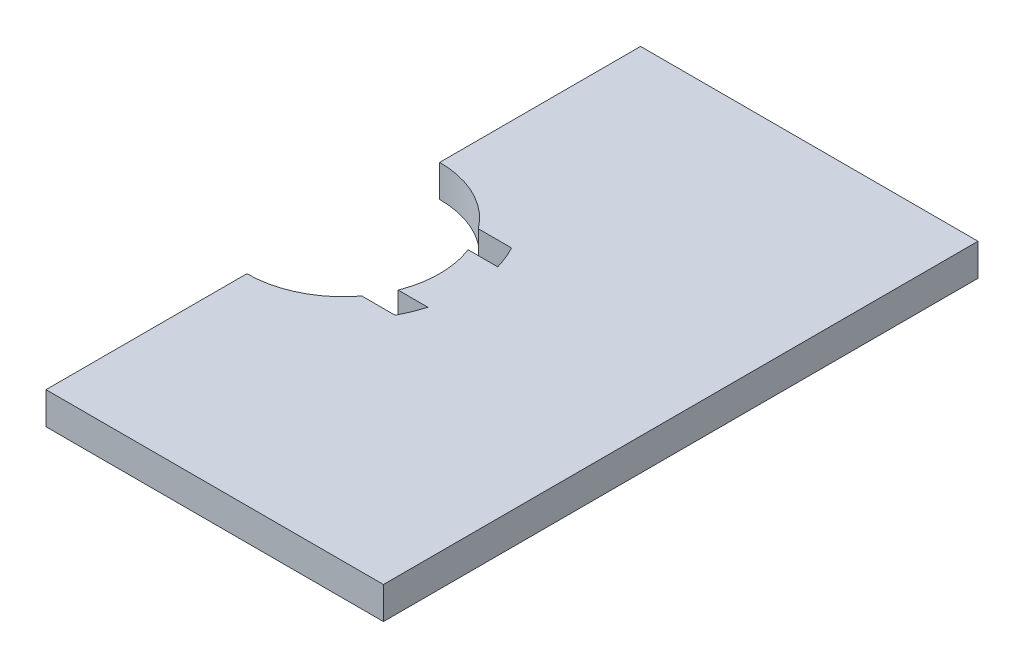
ISO-10303-21;
HEADER;
FILE_DESCRIPTION(('STEP AP214'),'2;1');
FILE_NAME('part.step','',(''),(''),'','','');
FILE_SCHEMA(('AUTOMOTIVE_DESIGN { 1 0 10303 214 1 1 1 1 }'));
ENDSEC;
DATA;
#1=APPLICATION_CONTEXT('core data for automotive mechanical design processes');
#2=APPLICATION_PROTOCOL_DEFINITION('international standard','automotive_design',2000,#1);
#3=PRODUCT_CONTEXT('',#1,'mechanical');
#4=PRODUCT('Part','Part','',(#3));
#5=PRODUCT_RELATED_PRODUCT_CATEGORY('part','',(#4));
#6=PRODUCT_DEFINITION_FORMATION('','',#4);
#7=PRODUCT_DEFINITION_CONTEXT('part definition',#1,'design');
#8=PRODUCT_DEFINITION('design','',#6,#7);
#9=PRODUCT_DEFINITION_SHAPE('','',#8);
#10=(LENGTH_UNIT() NAMED_UNIT(*) SI_UNIT(.MILLI.,.METRE.));
#11=(NAMED_UNIT(*) PLANE_ANGLE_UNIT() SI_UNIT($,.RADIAN.));
#12=(NAMED_UNIT(*) SI_UNIT($,.STERADIAN.) SOLID_ANGLE_UNIT());
#13=UNCERTAINTY_MEASURE_WITH_UNIT(LENGTH_MEASURE(1.E-05),#10,'distance_accuracy_value','');
#14=(GEOMETRIC_REPRESENTATION_CONTEXT(3) GLOBAL_UNCERTAINTY_ASSIGNED_CONTEXT((#13)) GLOBAL_UNIT_ASSIGNED_CONTEXT((#10,
#11,#12)) REPRESENTATION_CONTEXT('',''));
#15=CARTESIAN_POINT('',(0.,0.,0.));
#16=DIRECTION('',(0.,0.,1.));
#17=DIRECTION('',(1.,0.,0.));
#18=AXIS2_PLACEMENT_3D('',#15,#16,#17);
#19=CARTESIAN_POINT('',(0.,0.,0.));
#20=DIRECTION('',(1.,0.,0.));
#21=DIRECTION('',(0.,0.,-1.));
#22=AXIS2_PLACEMENT_3D('',#19,#20,#21);
#23=PLANE('',#22);
#24=DIRECTION('',(0.,0.,-1.));
#25=VECTOR('',#24,1.);
#26=CARTESIAN_POINT('',(0.,4.,0.));
#27=LINE('',#26,#25);
#28=CARTESIAN_POINT('',(0.,4.,37.));
#29=VERTEX_POINT('',#28);
#30=CARTESIAN_POINT('',(0.,4.,12.));
#31=VERTEX_POINT('',#30);
#32=EDGE_CURVE('E43',#29,#31,#27,.T.);
#33=ORIENTED_EDGE('',*,*,#32,.T.);
#34=DIRECTION('',(0.,-1.,0.));
#35=VECTOR('',#34,1.);
#36=CARTESIAN_POINT('',(0.,4.,12.));
#37=LINE('',#36,#35);
#38=CARTESIAN_POINT('',(0.,0.,12.));
#39=VERTEX_POINT('',#38);
#40=EDGE_CURVE('E51',#31,#39,#37,.T.);
#41=ORIENTED_EDGE('',*,*,#40,.T.);
#42=DIRECTION('',(0.,0.,-1.));
#43=VECTOR('',#42,1.);
#44=CARTESIAN_POINT('',(0.,0.,0.));
#45=LINE('',#44,#43);
#46=CARTESIAN_POINT('',(0.,0.,37.));
#47=VERTEX_POINT('',#46);
#48=EDGE_CURVE('E236',#47,#39,#45,.T.);
#49=ORIENTED_EDGE('',*,*,#48,.F.);
#50=DIRECTION('',(0.,-1.,0.));
#51=VECTOR('',#50,1.);
#52=CARTESIAN_POINT('',(0.,4.,37.));
#53=LINE('',#52,#51);
#54=EDGE_CURVE('E38',#29,#47,#53,.T.);
#55=ORIENTED_EDGE('',*,*,#54,.F.);
#56=EDGE_LOOP('',(#33,#41,#49,#55));
#57=FACE_BOUND('',#56,.T.);
#58=ADVANCED_FACE('F34',(#57),#23,.F.);
#59=CARTESIAN_POINT('',(0.,4.,-12.));
#60=VERTEX_POINT('',#59);
#61=CARTESIAN_POINT('',(0.,4.,-37.));
#62=VERTEX_POINT('',#61);
#63=EDGE_CURVE('E11',#60,#62,#27,.T.);
#64=ORIENTED_EDGE('',*,*,#63,.T.);
#65=DIRECTION('',(0.,-1.,0.));
#66=VECTOR('',#65,1.);
#67=CARTESIAN_POINT('',(0.,4.,-37.));
#68=LINE('',#67,#66);
#69=CARTESIAN_POINT('',(0.,0.,-37.));
#70=VERTEX_POINT('',#69);
#71=EDGE_CURVE('E238',#62,#70,#68,.T.);
#72=ORIENTED_EDGE('',*,*,#71,.T.);
#73=CARTESIAN_POINT('',(0.,0.,-12.));
#74=VERTEX_POINT('',#73);
#75=EDGE_CURVE('E221',#74,#70,#45,.T.);
#76=ORIENTED_EDGE('',*,*,#75,.F.);
#77=DIRECTION('',(0.,-1.,0.));
#78=VECTOR('',#77,1.);
#79=CARTESIAN_POINT('',(0.,4.,-12.));
#80=LINE('',#79,#78);
#81=EDGE_CURVE('E58',#74,#60,#80,.F.);
#82=ORIENTED_EDGE('',*,*,#81,.T.);
#83=EDGE_LOOP('',(#64,#72,#76,#82));
#84=FACE_BOUND('',#83,.T.);
#85=ADVANCED_FACE('F36',(#84),#23,.F.);
#86=CARTESIAN_POINT('',(42.,4.,0.));
#87=DIRECTION('',(-1.,0.,0.));
#88=DIRECTION('',(0.,0.,1.));
#89=AXIS2_PLACEMENT_3D('',#86,#87,#88);
#90=PLANE('',#89);
#91=DIRECTION('',(0.,0.,-1.));
#92=VECTOR('',#91,1.);
#93=CARTESIAN_POINT('',(42.,0.,0.));
#94=LINE('',#93,#92);
#95=CARTESIAN_POINT('',(42.,0.,37.));
#96=VERTEX_POINT('',#95);
#97=CARTESIAN_POINT('',(42.,0.,-37.));
#98=VERTEX_POINT('',#97);
#99=EDGE_CURVE('E212',#96,#98,#94,.T.);
#100=ORIENTED_EDGE('',*,*,#99,.T.);
#101=DIRECTION('',(0.,-1.,0.));
#102=VECTOR('',#101,1.);
#103=CARTESIAN_POINT('',(42.,4.,-37.));
#104=LINE('',#103,#102);
#105=CARTESIAN_POINT('',(42.,4.,-37.));
#106=VERTEX_POINT('',#105);
#107=EDGE_CURVE('E148',#106,#98,#104,.T.);
#108=ORIENTED_EDGE('',*,*,#107,.F.);
#109=DIRECTION('',(0.,0.,-1.));
#110=VECTOR('',#109,1.);
#111=CARTESIAN_POINT('',(42.,4.,0.));
#112=LINE('',#111,#110);
#113=CARTESIAN_POINT('',(42.,4.,37.));
#114=VERTEX_POINT('',#113);
#115=EDGE_CURVE('E183',#114,#106,#112,.T.);
#116=ORIENTED_EDGE('',*,*,#115,.F.);
#117=DIRECTION('',(0.,-1.,0.));
#118=VECTOR('',#117,1.);
#119=CARTESIAN_POINT('',(42.,4.,37.));
#120=LINE('',#119,#118);
#121=EDGE_CURVE('E218',#114,#96,#120,.T.);
#122=ORIENTED_EDGE('',*,*,#121,.T.);
#123=EDGE_LOOP('',(#100,#108,#116,#122));
#124=FACE_BOUND('',#123,.T.);
#125=ADVANCED_FACE('F282',(#124),#90,.F.);
#126=CARTESIAN_POINT('',(0.,4.,-37.));
#127=DIRECTION('',(0.,0.,-1.));
#128=DIRECTION('',(-1.,0.,0.));
#129=AXIS2_PLACEMENT_3D('',#126,#127,#128);
#130=PLANE('',#129);
#131=ORIENTED_EDGE('',*,*,#71,.F.);
#132=DIRECTION('',(1.,0.,0.));
#133=VECTOR('',#132,1.);
#134=CARTESIAN_POINT('',(0.,4.,-37.));
#135=LINE('',#134,#133);
#136=EDGE_CURVE('E186',#62,#106,#135,.T.);
#137=ORIENTED_EDGE('',*,*,#136,.T.);
#138=ORIENTED_EDGE('',*,*,#107,.T.);
#139=DIRECTION('',(1.,0.,0.));
#140=VECTOR('',#139,1.);
#141=CARTESIAN_POINT('',(0.,0.,-37.));
#142=LINE('',#141,#140);
#143=EDGE_CURVE('E162',#70,#98,#142,.T.);
#144=ORIENTED_EDGE('',*,*,#143,.F.);
#145=EDGE_LOOP('',(#131,#137,#138,#144));
#146=FACE_BOUND('',#145,.T.);
#147=ADVANCED_FACE('F279',(#146),#130,.T.);
#148=CARTESIAN_POINT('',(0.,4.,0.));
#149=DIRECTION('',(0.,-1.,0.));
#150=DIRECTION('',(0.,0.,-1.));
#151=AXIS2_PLACEMENT_3D('',#148,#149,#150);
#152=CYLINDRICAL_SURFACE('',#151,12.);
#153=ORIENTED_EDGE('',*,*,#81,.F.);
#154=CARTESIAN_POINT('',(0.,0.,0.));
#155=DIRECTION('',(0.,1.,0.));
#156=DIRECTION('',(0.,0.,1.));
#157=AXIS2_PLACEMENT_3D('',#154,#155,#156);
#158=CIRCLE('',#157,12.);
#159=CARTESIAN_POINT('',(9.56229574945264,0.,-7.25));
#160=VERTEX_POINT('',#159);
#161=EDGE_CURVE('E196',#160,#74,#158,.T.);
#162=ORIENTED_EDGE('',*,*,#161,.F.);
#163=DIRECTION('',(0.,-1.,0.));
#164=VECTOR('',#163,1.);
#165=CARTESIAN_POINT('',(9.56229574945264,4.,-7.25));
#166=LINE('',#165,#164);
#167=CARTESIAN_POINT('',(9.56229574945264,4.,-7.25));
#168=VERTEX_POINT('',#167);
#169=EDGE_CURVE('E223',#168,#160,#166,.T.);
#170=ORIENTED_EDGE('',*,*,#169,.F.);
#171=CARTESIAN_POINT('',(0.,4.,0.));
#172=DIRECTION('',(0.,1.,0.));
#173=DIRECTION('',(0.,0.,1.));
#174=AXIS2_PLACEMENT_3D('',#171,#172,#173);
#175=CIRCLE('',#174,12.);
#176=EDGE_CURVE('E169',#168,#60,#175,.T.);
#177=ORIENTED_EDGE('',*,*,#176,.T.);
#178=EDGE_LOOP('',(#153,#162,#170,#177));
#179=FACE_BOUND('',#178,.T.);
#180=ADVANCED_FACE('F274',(#179),#152,.F.);
#181=CARTESIAN_POINT('',(0.,4.,-7.25));
#182=DIRECTION('',(0.,0.,-1.));
#183=DIRECTION('',(-1.,0.,0.));
#184=AXIS2_PLACEMENT_3D('',#181,#182,#183);
#185=PLANE('',#184);
#186=DIRECTION('',(1.,0.,0.));
#187=VECTOR('',#186,1.);
#188=CARTESIAN_POINT('',(0.,0.,-7.25));
#189=LINE('',#188,#187);
#190=CARTESIAN_POINT('',(13.6999087588203,0.,-7.25));
#191=VERTEX_POINT('',#190);
#192=EDGE_CURVE('E207',#160,#191,#189,.T.);
#193=ORIENTED_EDGE('',*,*,#192,.T.);
#194=DIRECTION('',(0.,-1.,0.));
#195=VECTOR('',#194,1.);
#196=CARTESIAN_POINT('',(13.6999087588203,4.,-7.25));
#197=LINE('',#196,#195);
#198=CARTESIAN_POINT('',(13.6999087588203,4.,-7.25));
#199=VERTEX_POINT('',#198);
#200=EDGE_CURVE('E188',#199,#191,#197,.T.);
#201=ORIENTED_EDGE('',*,*,#200,.F.);
#202=DIRECTION('',(1.,0.,0.));
#203=VECTOR('',#202,1.);
#204=CARTESIAN_POINT('',(0.,4.,-7.25));
#205=LINE('',#204,#203);
#206=EDGE_CURVE('E160',#168,#199,#205,.T.);
#207=ORIENTED_EDGE('',*,*,#206,.F.);
#208=ORIENTED_EDGE('',*,*,#169,.T.);
#209=EDGE_LOOP('',(#193,#201,#207,#208));
#210=FACE_BOUND('',#209,.T.);
#211=ADVANCED_FACE('F314',(#210),#185,.F.);
#212=CARTESIAN_POINT('',(0.,4.,0.));
#213=DIRECTION('',(0.,-1.,0.));
#214=DIRECTION('',(0.,0.,-1.));
#215=AXIS2_PLACEMENT_3D('',#212,#213,#214);
#216=CYLINDRICAL_SURFACE('',#215,15.5);
#217=CARTESIAN_POINT('',(0.,0.,0.));
#218=DIRECTION('',(0.,1.,0.));
#219=DIRECTION('',(0.,0.,1.));
#220=AXIS2_PLACEMENT_3D('',#217,#218,#219);
#221=CIRCLE('',#220,15.5);
#222=CARTESIAN_POINT('',(14.8770796865514,0.,-4.35));
#223=VERTEX_POINT('',#222);
#224=EDGE_CURVE('E143',#223,#191,#221,.T.);
#225=ORIENTED_EDGE('',*,*,#224,.F.);
#226=DIRECTION('',(0.,-1.,0.));
#227=VECTOR('',#226,1.);
#228=CARTESIAN_POINT('',(14.8770796865514,4.,-4.35));
#229=LINE('',#228,#227);
#230=CARTESIAN_POINT('',(14.8770796865514,4.,-4.35));
#231=VERTEX_POINT('',#230);
#232=EDGE_CURVE('E138',#231,#223,#229,.T.);
#233=ORIENTED_EDGE('',*,*,#232,.F.);
#234=CARTESIAN_POINT('',(0.,4.,0.));
#235=DIRECTION('',(0.,1.,0.));
#236=DIRECTION('',(0.,0.,1.));
#237=AXIS2_PLACEMENT_3D('',#234,#235,#236);
#238=CIRCLE('',#237,15.5);
#239=EDGE_CURVE('E141',#231,#199,#238,.T.);
#240=ORIENTED_EDGE('',*,*,#239,.T.);
#241=ORIENTED_EDGE('',*,*,#200,.T.);
#242=EDGE_LOOP('',(#225,#233,#240,#241));
#243=FACE_BOUND('',#242,.T.);
#244=ADVANCED_FACE('F140',(#243),#216,.F.);
#245=CARTESIAN_POINT('',(0.,4.,-4.34999999999999));
#246=DIRECTION('',(0.,0.,-1.));
#247=DIRECTION('',(-1.,0.,0.));
#248=AXIS2_PLACEMENT_3D('',#245,#246,#247);
#249=PLANE('',#248);
#250=DIRECTION('',(1.,0.,0.));
#251=VECTOR('',#250,1.);
#252=CARTESIAN_POINT('',(0.,0.,-4.34999999999999));
#253=LINE('',#252,#251);
#254=CARTESIAN_POINT('',(11.1838052558152,0.,-4.35));
#255=VERTEX_POINT('',#254);
#256=EDGE_CURVE('E190',#255,#223,#253,.T.);
#257=ORIENTED_EDGE('',*,*,#256,.F.);
#258=DIRECTION('',(0.,-1.,0.));
#259=VECTOR('',#258,1.);
#260=CARTESIAN_POINT('',(11.1838052558152,4.,-4.35));
#261=LINE('',#260,#259);
#262=CARTESIAN_POINT('',(11.1838052558152,4.,-4.35));
#263=VERTEX_POINT('',#262);
#264=EDGE_CURVE('E149',#263,#255,#261,.T.);
#265=ORIENTED_EDGE('',*,*,#264,.F.);
#266=DIRECTION('',(1.,0.,0.));
#267=VECTOR('',#266,1.);
#268=CARTESIAN_POINT('',(0.,4.,-4.34999999999999));
#269=LINE('',#268,#267);
#270=EDGE_CURVE('E156',#263,#231,#269,.T.);
#271=ORIENTED_EDGE('',*,*,#270,.T.);
#272=ORIENTED_EDGE('',*,*,#232,.T.);
#273=EDGE_LOOP('',(#257,#265,#271,#272));
#274=FACE_BOUND('',#273,.T.);
#275=ADVANCED_FACE('F164',(#274),#249,.T.);
#276=CARTESIAN_POINT('',(11.1838052558152,0.,4.35));
#277=VERTEX_POINT('',#276);
#278=EDGE_CURVE('E192',#277,#255,#158,.T.);
#279=ORIENTED_EDGE('',*,*,#278,.F.);
#280=DIRECTION('',(0.,-1.,0.));
#281=VECTOR('',#280,1.);
#282=CARTESIAN_POINT('',(11.1838052558152,4.,4.35));
#283=LINE('',#282,#281);
#284=CARTESIAN_POINT('',(11.1838052558152,4.,4.35));
#285=VERTEX_POINT('',#284);
#286=EDGE_CURVE('E232',#285,#277,#283,.T.);
#287=ORIENTED_EDGE('',*,*,#286,.F.);
#288=EDGE_CURVE('E165',#285,#263,#175,.T.);
#289=ORIENTED_EDGE('',*,*,#288,.T.);
#290=ORIENTED_EDGE('',*,*,#264,.T.);
#291=EDGE_LOOP('',(#279,#287,#289,#290));
#292=FACE_BOUND('',#291,.T.);
#293=ADVANCED_FACE('F267',(#292),#152,.F.);
#294=CARTESIAN_POINT('',(0.,4.,4.34999999999999));
#295=DIRECTION('',(0.,0.,-1.));
#296=DIRECTION('',(-1.,0.,0.));
#297=AXIS2_PLACEMENT_3D('',#294,#295,#296);
#298=PLANE('',#297);
#299=DIRECTION('',(1.,0.,0.));
#300=VECTOR('',#299,1.);
#301=CARTESIAN_POINT('',(0.,0.,4.34999999999999));
#302=LINE('',#301,#300);
#303=CARTESIAN_POINT('',(14.8770796865514,0.,4.35));
#304=VERTEX_POINT('',#303);
#305=EDGE_CURVE('E195',#277,#304,#302,.T.);
#306=ORIENTED_EDGE('',*,*,#305,.T.);
#307=DIRECTION('',(0.,-1.,0.));
#308=VECTOR('',#307,1.);
#309=CARTESIAN_POINT('',(14.8770796865514,4.,4.35));
#310=LINE('',#309,#308);
#311=CARTESIAN_POINT('',(14.8770796865514,4.,4.35));
#312=VERTEX_POINT('',#311);
#313=EDGE_CURVE('E230',#312,#304,#310,.T.);
#314=ORIENTED_EDGE('',*,*,#313,.F.);
#315=DIRECTION('',(1.,0.,0.));
#316=VECTOR('',#315,1.);
#317=CARTESIAN_POINT('',(0.,4.,4.34999999999999));
#318=LINE('',#317,#316);
#319=EDGE_CURVE('E167',#285,#312,#318,.T.);
#320=ORIENTED_EDGE('',*,*,#319,.F.);
#321=ORIENTED_EDGE('',*,*,#286,.T.);
#322=EDGE_LOOP('',(#306,#314,#320,#321));
#323=FACE_BOUND('',#322,.T.);
#324=ADVANCED_FACE('F358',(#323),#298,.F.);
#325=CARTESIAN_POINT('',(0.,4.,0.));
#326=DIRECTION('',(0.,-1.,0.));
#327=DIRECTION('',(0.,0.,-1.));
#328=AXIS2_PLACEMENT_3D('',#325,#326,#327);
#329=CYLINDRICAL_SURFACE('',#328,15.5);
#330=CARTESIAN_POINT('',(0.,0.,0.));
#331=DIRECTION('',(0.,1.,0.));
#332=DIRECTION('',(0.,0.,1.));
#333=AXIS2_PLACEMENT_3D('',#330,#331,#332);
#334=CIRCLE('',#333,15.5);
#335=CARTESIAN_POINT('',(13.6999087588203,0.,7.25000000000001));
#336=VERTEX_POINT('',#335);
#337=EDGE_CURVE('E199',#336,#304,#334,.T.);
#338=ORIENTED_EDGE('',*,*,#337,.F.);
#339=DIRECTION('',(0.,-1.,0.));
#340=VECTOR('',#339,1.);
#341=CARTESIAN_POINT('',(13.6999087588203,4.,7.25000000000001));
#342=LINE('',#341,#340);
#343=CARTESIAN_POINT('',(13.6999087588203,4.,7.25000000000001));
#344=VERTEX_POINT('',#343);
#345=EDGE_CURVE('E228',#344,#336,#342,.T.);
#346=ORIENTED_EDGE('',*,*,#345,.F.);
#347=CARTESIAN_POINT('',(0.,4.,0.));
#348=DIRECTION('',(0.,1.,0.));
#349=DIRECTION('',(0.,0.,1.));
#350=AXIS2_PLACEMENT_3D('',#347,#348,#349);
#351=CIRCLE('',#350,15.5);
#352=EDGE_CURVE('E172',#344,#312,#351,.T.);
#353=ORIENTED_EDGE('',*,*,#352,.T.);
#354=ORIENTED_EDGE('',*,*,#313,.T.);
#355=EDGE_LOOP('',(#338,#346,#353,#354));
#356=FACE_BOUND('',#355,.T.);
#357=ADVANCED_FACE('F261',(#356),#329,.F.);
#358=CARTESIAN_POINT('',(0.,4.,7.24999999999999));
#359=DIRECTION('',(0.,0.,-1.));
#360=DIRECTION('',(-1.,0.,0.));
#361=AXIS2_PLACEMENT_3D('',#358,#359,#360);
#362=PLANE('',#361);
#363=DIRECTION('',(1.,0.,0.));
#364=VECTOR('',#363,1.);
#365=CARTESIAN_POINT('',(0.,0.,7.24999999999999));
#366=LINE('',#365,#364);
#367=CARTESIAN_POINT('',(9.56229574945264,0.,7.25));
#368=VERTEX_POINT('',#367);
#369=EDGE_CURVE('E202',#368,#336,#366,.T.);
#370=ORIENTED_EDGE('',*,*,#369,.F.);
#371=DIRECTION('',(0.,-1.,0.));
#372=VECTOR('',#371,1.);
#373=CARTESIAN_POINT('',(9.56229574945264,4.,7.25));
#374=LINE('',#373,#372);
#375=CARTESIAN_POINT('',(9.56229574945264,4.,7.25));
#376=VERTEX_POINT('',#375);
#377=EDGE_CURVE('E225',#376,#368,#374,.T.);
#378=ORIENTED_EDGE('',*,*,#377,.F.);
#379=DIRECTION('',(1.,0.,0.));
#380=VECTOR('',#379,1.);
#381=CARTESIAN_POINT('',(0.,4.,7.24999999999999));
#382=LINE('',#381,#380);
#383=EDGE_CURVE('E175',#376,#344,#382,.T.);
#384=ORIENTED_EDGE('',*,*,#383,.T.);
#385=ORIENTED_EDGE('',*,*,#345,.T.);
#386=EDGE_LOOP('',(#370,#378,#384,#385));
#387=FACE_BOUND('',#386,.T.);
#388=ADVANCED_FACE('F258',(#387),#362,.T.);
#389=CARTESIAN_POINT('',(0.,4.,0.));
#390=DIRECTION('',(0.,-1.,0.));
#391=DIRECTION('',(0.,0.,-1.));
#392=AXIS2_PLACEMENT_3D('',#389,#390,#391);
#393=CYLINDRICAL_SURFACE('',#392,12.);
#394=ORIENTED_EDGE('',*,*,#40,.F.);
#395=CARTESIAN_POINT('',(0.,4.,0.));
#396=DIRECTION('',(0.,1.,0.));
#397=DIRECTION('',(0.,0.,1.));
#398=AXIS2_PLACEMENT_3D('',#395,#396,#397);
#399=CIRCLE('',#398,12.);
#400=EDGE_CURVE('E178',#31,#376,#399,.T.);
#401=ORIENTED_EDGE('',*,*,#400,.T.);
#402=ORIENTED_EDGE('',*,*,#377,.T.);
#403=CARTESIAN_POINT('',(0.,0.,0.));
#404=DIRECTION('',(0.,1.,0.));
#405=DIRECTION('',(0.,0.,1.));
#406=AXIS2_PLACEMENT_3D('',#403,#404,#405);
#407=CIRCLE('',#406,12.);
#408=EDGE_CURVE('E205',#39,#368,#407,.T.);
#409=ORIENTED_EDGE('',*,*,#408,.F.);
#410=EDGE_LOOP('',(#394,#401,#402,#409));
#411=FACE_BOUND('',#410,.T.);
#412=ADVANCED_FACE('F244',(#411),#393,.F.);
#413=CARTESIAN_POINT('',(0.,4.,37.));
#414=DIRECTION('',(0.,0.,-1.));
#415=DIRECTION('',(-1.,0.,0.));
#416=AXIS2_PLACEMENT_3D('',#413,#414,#415);
#417=PLANE('',#416);
#418=DIRECTION('',(1.,0.,0.));
#419=VECTOR('',#418,1.);
#420=CARTESIAN_POINT('',(0.,4.,37.));
#421=LINE('',#420,#419);
#422=EDGE_CURVE('E181',#29,#114,#421,.T.);
#423=ORIENTED_EDGE('',*,*,#422,.F.);
#424=ORIENTED_EDGE('',*,*,#54,.T.);
#425=DIRECTION('',(1.,0.,0.));
#426=VECTOR('',#425,1.);
#427=CARTESIAN_POINT('',(0.,0.,37.));
#428=LINE('',#427,#426);
#429=EDGE_CURVE('E210',#47,#96,#428,.T.);
#430=ORIENTED_EDGE('',*,*,#429,.T.);
#431=ORIENTED_EDGE('',*,*,#121,.F.);
#432=EDGE_LOOP('',(#423,#424,#430,#431));
#433=FACE_BOUND('',#432,.T.);
#434=ADVANCED_FACE('F252',(#433),#417,.F.);
#435=CARTESIAN_POINT('',(0.,0.,0.));
#436=DIRECTION('',(0.,1.,0.));
#437=DIRECTION('',(0.,0.,1.));
#438=AXIS2_PLACEMENT_3D('',#435,#436,#437);
#439=PLANE('',#438);
#440=ORIENTED_EDGE('',*,*,#429,.F.);
#441=ORIENTED_EDGE('',*,*,#48,.T.);
#442=ORIENTED_EDGE('',*,*,#408,.T.);
#443=ORIENTED_EDGE('',*,*,#369,.T.);
#444=ORIENTED_EDGE('',*,*,#337,.T.);
#445=ORIENTED_EDGE('',*,*,#305,.F.);
#446=ORIENTED_EDGE('',*,*,#278,.T.);
#447=ORIENTED_EDGE('',*,*,#256,.T.);
#448=ORIENTED_EDGE('',*,*,#224,.T.);
#449=ORIENTED_EDGE('',*,*,#192,.F.);
#450=ORIENTED_EDGE('',*,*,#161,.T.);
#451=ORIENTED_EDGE('',*,*,#75,.T.);
#452=ORIENTED_EDGE('',*,*,#143,.T.);
#453=ORIENTED_EDGE('',*,*,#99,.F.);
#454=EDGE_LOOP('',(#440,#441,#442,#443,#444,#445,#446,#447,#448,#449,#450,#451,#452,#453));
#455=FACE_BOUND('',#454,.T.);
#456=ADVANCED_FACE('F248',(#455),#439,.F.);
#457=CARTESIAN_POINT('',(0.,4.,0.));
#458=DIRECTION('',(0.,1.,0.));
#459=DIRECTION('',(0.,0.,1.));
#460=AXIS2_PLACEMENT_3D('',#457,#458,#459);
#461=PLANE('',#460);
#462=ORIENTED_EDGE('',*,*,#32,.F.);
#463=ORIENTED_EDGE('',*,*,#422,.T.);
#464=ORIENTED_EDGE('',*,*,#115,.T.);
#465=ORIENTED_EDGE('',*,*,#136,.F.);
#466=ORIENTED_EDGE('',*,*,#63,.F.);
#467=ORIENTED_EDGE('',*,*,#176,.F.);
#468=ORIENTED_EDGE('',*,*,#206,.T.);
#469=ORIENTED_EDGE('',*,*,#239,.F.);
#470=ORIENTED_EDGE('',*,*,#270,.F.);
#471=ORIENTED_EDGE('',*,*,#288,.F.);
#472=ORIENTED_EDGE('',*,*,#319,.T.);
#473=ORIENTED_EDGE('',*,*,#352,.F.);
#474=ORIENTED_EDGE('',*,*,#383,.F.);
#475=ORIENTED_EDGE('',*,*,#400,.F.);
#476=EDGE_LOOP('',(#462,#463,#464,#465,#466,#467,#468,#469,#470,#471,#472,#473,#474,#475));
#477=FACE_BOUND('',#476,.T.);
#478=ADVANCED_FACE('F154',(#477),#461,.T.);
#479=CLOSED_SHELL('',(#58,#85,#125,#147,#180,#211,#244,#275,#293,#324,#357,#388,#412,#434,#456,#478));
#480=MANIFOLD_SOLID_BREP('B2',#479);
#481=ADVANCED_BREP_SHAPE_REPRESENTATION('',(#18,#480),#14);
#482=SHAPE_DEFINITION_REPRESENTATION(#9,#481);
ENDSEC;
END-ISO-10303-21;
